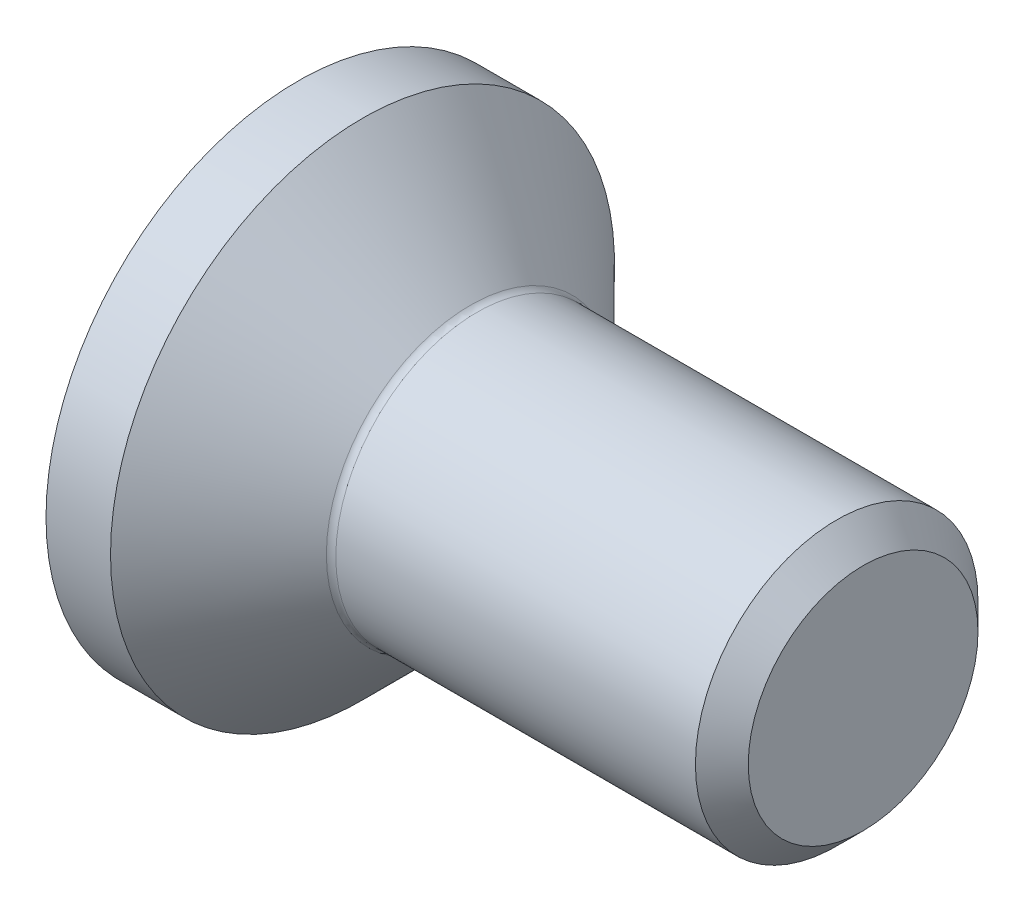
ISO-10303-21;
HEADER;
FILE_DESCRIPTION(('STEP AP214'),'2;1');
FILE_NAME('part.step','',(''),(''),'','','');
FILE_SCHEMA(('AUTOMOTIVE_DESIGN { 1 0 10303 214 1 1 1 1 }'));
ENDSEC;
DATA;
#1=APPLICATION_CONTEXT('core data for automotive mechanical design processes');
#2=APPLICATION_PROTOCOL_DEFINITION('international standard','automotive_design',2000,#1);
#3=PRODUCT_CONTEXT('',#1,'mechanical');
#4=PRODUCT('Part','Part','',(#3));
#5=PRODUCT_RELATED_PRODUCT_CATEGORY('part','',(#4));
#6=PRODUCT_DEFINITION_FORMATION('','',#4);
#7=PRODUCT_DEFINITION_CONTEXT('part definition',#1,'design');
#8=PRODUCT_DEFINITION('design','',#6,#7);
#9=PRODUCT_DEFINITION_SHAPE('','',#8);
#10=(LENGTH_UNIT() NAMED_UNIT(*) SI_UNIT(.MILLI.,.METRE.));
#11=(NAMED_UNIT(*) PLANE_ANGLE_UNIT() SI_UNIT($,.RADIAN.));
#12=(NAMED_UNIT(*) SI_UNIT($,.STERADIAN.) SOLID_ANGLE_UNIT());
#13=UNCERTAINTY_MEASURE_WITH_UNIT(LENGTH_MEASURE(1.E-05),#10,'distance_accuracy_value','');
#14=(GEOMETRIC_REPRESENTATION_CONTEXT(3) GLOBAL_UNCERTAINTY_ASSIGNED_CONTEXT((#13)) GLOBAL_UNIT_ASSIGNED_CONTEXT((#10,
#11,#12)) REPRESENTATION_CONTEXT('',''));
#15=CARTESIAN_POINT('',(0.,0.,0.));
#16=DIRECTION('',(0.,0.,1.));
#17=DIRECTION('',(1.,0.,0.));
#18=AXIS2_PLACEMENT_3D('',#15,#16,#17);
#19=CARTESIAN_POINT('',(0.,0.,0.));
#20=DIRECTION('',(-1.,0.,0.));
#21=DIRECTION('',(0.,0.,1.));
#22=AXIS2_PLACEMENT_3D('',#19,#20,#21);
#23=PLANE('',#22);
#24=CARTESIAN_POINT('',(0.,0.,0.));
#25=DIRECTION('',(-1.,0.,0.));
#26=DIRECTION('',(0.,0.,1.));
#27=AXIS2_PLACEMENT_3D('',#24,#25,#26);
#28=CIRCLE('',#27,2.675);
#29=CARTESIAN_POINT('',(0.,0.,2.675));
#30=VERTEX_POINT('',#29);
#31=EDGE_CURVE('E148',#30,#30,#28,.T.);
#32=ORIENTED_EDGE('',*,*,#31,.T.);
#33=EDGE_LOOP('',(#32));
#34=FACE_BOUND('',#33,.T.);
#35=DIRECTION('',(0.,-0.5,-0.866025403784439));
#36=VECTOR('',#35,1.);
#37=CARTESIAN_POINT('',(0.,-0.577350269189625,1.));
#38=LINE('',#37,#36);
#39=CARTESIAN_POINT('',(0.,-0.577350269189625,1.));
#40=VERTEX_POINT('',#39);
#41=CARTESIAN_POINT('',(0.,-1.15470053837925,0.));
#42=VERTEX_POINT('',#41);
#43=EDGE_CURVE('E114',#40,#42,#38,.T.);
#44=ORIENTED_EDGE('',*,*,#43,.T.);
#45=DIRECTION('',(0.,0.5,-0.866025403784439));
#46=VECTOR('',#45,1.);
#47=CARTESIAN_POINT('',(0.,-1.15470053837925,0.));
#48=LINE('',#47,#46);
#49=CARTESIAN_POINT('',(0.,-0.577350269189626,-1.));
#50=VERTEX_POINT('',#49);
#51=EDGE_CURVE('E45',#42,#50,#48,.T.);
#52=ORIENTED_EDGE('',*,*,#51,.T.);
#53=DIRECTION('',(0.,1.,0.));
#54=VECTOR('',#53,1.);
#55=CARTESIAN_POINT('',(0.,-0.577350269189626,-1.));
#56=LINE('',#55,#54);
#57=CARTESIAN_POINT('',(0.,0.577350269189627,-1.));
#58=VERTEX_POINT('',#57);
#59=EDGE_CURVE('E125',#50,#58,#56,.T.);
#60=ORIENTED_EDGE('',*,*,#59,.T.);
#61=DIRECTION('',(0.,0.5,0.866025403784438));
#62=VECTOR('',#61,1.);
#63=CARTESIAN_POINT('',(0.,0.577350269189627,-1.));
#64=LINE('',#63,#62);
#65=CARTESIAN_POINT('',(0.,1.15470053837925,0.));
#66=VERTEX_POINT('',#65);
#67=EDGE_CURVE('E249',#58,#66,#64,.T.);
#68=ORIENTED_EDGE('',*,*,#67,.T.);
#69=DIRECTION('',(0.,-0.5,0.866025403784438));
#70=VECTOR('',#69,1.);
#71=CARTESIAN_POINT('',(0.,1.15470053837925,0.));
#72=LINE('',#71,#70);
#73=CARTESIAN_POINT('',(0.,0.577350269189627,1.));
#74=VERTEX_POINT('',#73);
#75=EDGE_CURVE('E252',#66,#74,#72,.T.);
#76=ORIENTED_EDGE('',*,*,#75,.T.);
#77=DIRECTION('',(0.,-1.,0.));
#78=VECTOR('',#77,1.);
#79=CARTESIAN_POINT('',(0.,0.577350269189627,1.));
#80=LINE('',#79,#78);
#81=EDGE_CURVE('E255',#74,#40,#80,.T.);
#82=ORIENTED_EDGE('',*,*,#81,.T.);
#83=EDGE_LOOP('',(#44,#52,#60,#68,#76,#82));
#84=FACE_BOUND('',#83,.T.);
#85=ADVANCED_FACE('F30',(#34,#84),#23,.T.);
#86=CARTESIAN_POINT('',(0.,0.,0.));
#87=DIRECTION('',(-1.,0.,0.));
#88=DIRECTION('',(0.,0.,1.));
#89=AXIS2_PLACEMENT_3D('',#86,#87,#88);
#90=CYLINDRICAL_SURFACE('',#89,2.675);
#91=CARTESIAN_POINT('',(0.685000000000005,0.,0.));
#92=DIRECTION('',(-1.,0.,0.));
#93=DIRECTION('',(0.,0.,1.));
#94=AXIS2_PLACEMENT_3D('',#91,#92,#93);
#95=CIRCLE('',#94,2.675);
#96=CARTESIAN_POINT('',(0.685000000000005,0.,2.675));
#97=VERTEX_POINT('',#96);
#98=EDGE_CURVE('E145',#97,#97,#95,.T.);
#99=ORIENTED_EDGE('',*,*,#98,.T.);
#100=EDGE_LOOP('',(#99));
#101=FACE_BOUND('',#100,.T.);
#102=ORIENTED_EDGE('',*,*,#31,.F.);
#103=EDGE_LOOP('',(#102));
#104=FACE_BOUND('',#103,.T.);
#105=ADVANCED_FACE('F169',(#101,#104),#90,.T.);
#106=CARTESIAN_POINT('',(0.685000000000005,0.,0.));
#107=DIRECTION('',(-1.,0.,0.));
#108=DIRECTION('',(0.,0.,1.));
#109=AXIS2_PLACEMENT_3D('',#106,#107,#108);
#110=CONICAL_SURFACE('',#109,2.675,0.78539816339745);
#111=CARTESIAN_POINT('',(1.83071067811866,0.,0.));
#112=DIRECTION('',(-1.,0.,0.));
#113=DIRECTION('',(0.,0.,1.));
#114=AXIS2_PLACEMENT_3D('',#111,#112,#113);
#115=CIRCLE('',#114,1.52928932188134);
#116=CARTESIAN_POINT('',(1.83071067811866,0.,1.52928932188134));
#117=VERTEX_POINT('',#116);
#118=EDGE_CURVE('E38',#117,#117,#115,.T.);
#119=ORIENTED_EDGE('',*,*,#118,.T.);
#120=EDGE_LOOP('',(#119));
#121=FACE_BOUND('',#120,.T.);
#122=ORIENTED_EDGE('',*,*,#98,.F.);
#123=EDGE_LOOP('',(#122));
#124=FACE_BOUND('',#123,.T.);
#125=ADVANCED_FACE('F153',(#121,#124),#110,.T.);
#126=CARTESIAN_POINT('',(0.,0.,0.));
#127=DIRECTION('',(-1.,0.,0.));
#128=DIRECTION('',(0.,0.,1.));
#129=AXIS2_PLACEMENT_3D('',#126,#127,#128);
#130=CYLINDRICAL_SURFACE('',#129,1.5);
#131=CARTESIAN_POINT('',(1.90142135623731,0.,0.));
#132=DIRECTION('',(-1.,0.,0.));
#133=DIRECTION('',(0.,0.,1.));
#134=AXIS2_PLACEMENT_3D('',#131,#132,#133);
#135=CIRCLE('',#134,1.5);
#136=CARTESIAN_POINT('',(1.90142135623731,0.,1.5));
#137=VERTEX_POINT('',#136);
#138=EDGE_CURVE('E11',#137,#137,#135,.F.);
#139=ORIENTED_EDGE('',*,*,#138,.T.);
#140=EDGE_LOOP('',(#139));
#141=FACE_BOUND('',#140,.T.);
#142=CARTESIAN_POINT('',(5.7195,0.,0.));
#143=DIRECTION('',(-1.,0.,0.));
#144=DIRECTION('',(0.,0.,1.));
#145=AXIS2_PLACEMENT_3D('',#142,#143,#144);
#146=CIRCLE('',#145,1.49999999999999);
#147=CARTESIAN_POINT('',(5.7195,0.,1.49999999999999));
#148=VERTEX_POINT('',#147);
#149=EDGE_CURVE('E142',#148,#148,#146,.T.);
#150=ORIENTED_EDGE('',*,*,#149,.T.);
#151=EDGE_LOOP('',(#150));
#152=FACE_BOUND('',#151,.T.);
#153=ADVANCED_FACE('F180',(#141,#152),#130,.T.);
#154=CARTESIAN_POINT('',(6.,0.,0.));
#155=DIRECTION('',(-1.,0.,0.));
#156=DIRECTION('',(0.,0.,1.));
#157=AXIS2_PLACEMENT_3D('',#154,#155,#156);
#158=CONICAL_SURFACE('',#157,1.2195,0.785398163397434);
#159=ORIENTED_EDGE('',*,*,#149,.F.);
#160=EDGE_LOOP('',(#159));
#161=FACE_BOUND('',#160,.T.);
#162=CARTESIAN_POINT('',(6.,0.,0.));
#163=DIRECTION('',(-1.,0.,0.));
#164=DIRECTION('',(0.,0.,1.));
#165=AXIS2_PLACEMENT_3D('',#162,#163,#164);
#166=CIRCLE('',#165,1.2195);
#167=CARTESIAN_POINT('',(6.,0.,1.2195));
#168=VERTEX_POINT('',#167);
#169=EDGE_CURVE('E138',#168,#168,#166,.T.);
#170=ORIENTED_EDGE('',*,*,#169,.T.);
#171=EDGE_LOOP('',(#170));
#172=FACE_BOUND('',#171,.T.);
#173=ADVANCED_FACE('F164',(#161,#172),#158,.T.);
#174=CARTESIAN_POINT('',(6.,1.2195,0.));
#175=DIRECTION('',(1.,0.,0.));
#176=DIRECTION('',(0.,0.,-1.));
#177=AXIS2_PLACEMENT_3D('',#174,#175,#176);
#178=PLANE('',#177);
#179=ORIENTED_EDGE('',*,*,#169,.F.);
#180=EDGE_LOOP('',(#179));
#181=FACE_BOUND('',#180,.T.);
#182=ADVANCED_FACE('F157',(#181),#178,.T.);
#183=CARTESIAN_POINT('',(1.90142135623731,0.,0.));
#184=DIRECTION('',(-1.,0.,0.));
#185=DIRECTION('',(0.,0.,1.));
#186=AXIS2_PLACEMENT_3D('',#183,#184,#185);
#187=TOROIDAL_SURFACE('',#186,1.6,0.1);
#188=ORIENTED_EDGE('',*,*,#138,.F.);
#189=EDGE_LOOP('',(#188));
#190=FACE_BOUND('',#189,.T.);
#191=ORIENTED_EDGE('',*,*,#118,.F.);
#192=EDGE_LOOP('',(#191));
#193=FACE_BOUND('',#192,.T.);
#194=ADVANCED_FACE('F32',(#190,#193),#187,.F.);
#195=CARTESIAN_POINT('',(1.1,-1.15470053837925,0.));
#196=DIRECTION('',(0.,0.866025403784439,0.5));
#197=DIRECTION('',(0.,-0.5,0.866025403784439));
#198=AXIS2_PLACEMENT_3D('',#195,#196,#197);
#199=PLANE('',#198);
#200=ORIENTED_EDGE('',*,*,#51,.F.);
#201=DIRECTION('',(-1.,0.,0.));
#202=VECTOR('',#201,1.);
#203=CARTESIAN_POINT('',(1.1,-1.15470053837925,0.));
#204=LINE('',#203,#202);
#205=CARTESIAN_POINT('',(1.1,-1.15470053837925,0.));
#206=VERTEX_POINT('',#205);
#207=EDGE_CURVE('E246',#206,#42,#204,.T.);
#208=ORIENTED_EDGE('',*,*,#207,.F.);
#209=DIRECTION('',(0.,0.5,-0.866025403784439));
#210=VECTOR('',#209,1.);
#211=CARTESIAN_POINT('',(1.1,-1.15470053837925,0.));
#212=LINE('',#211,#210);
#213=CARTESIAN_POINT('',(1.1,-0.866025403784439,-0.499999999999999));
#214=VERTEX_POINT('',#213);
#215=EDGE_CURVE('E110',#206,#214,#212,.T.);
#216=ORIENTED_EDGE('',*,*,#215,.T.);
#217=CARTESIAN_POINT('',(1.1,-0.577350269189626,-1.));
#218=VERTEX_POINT('',#217);
#219=EDGE_CURVE('E106',#214,#218,#212,.T.);
#220=ORIENTED_EDGE('',*,*,#219,.T.);
#221=DIRECTION('',(-1.,0.,0.));
#222=VECTOR('',#221,1.);
#223=CARTESIAN_POINT('',(1.1,-0.577350269189626,-1.));
#224=LINE('',#223,#222);
#225=EDGE_CURVE('E108',#218,#50,#224,.T.);
#226=ORIENTED_EDGE('',*,*,#225,.T.);
#227=EDGE_LOOP('',(#200,#208,#216,#220,#226));
#228=FACE_BOUND('',#227,.T.);
#229=ADVANCED_FACE('F107',(#228),#199,.T.);
#230=CARTESIAN_POINT('',(1.1,-0.577350269189626,-1.));
#231=DIRECTION('',(0.,0.,1.));
#232=DIRECTION('',(1.,0.,0.));
#233=AXIS2_PLACEMENT_3D('',#230,#231,#232);
#234=PLANE('',#233);
#235=ORIENTED_EDGE('',*,*,#59,.F.);
#236=ORIENTED_EDGE('',*,*,#225,.F.);
#237=DIRECTION('',(0.,1.,0.));
#238=VECTOR('',#237,1.);
#239=CARTESIAN_POINT('',(1.1,-0.577350269189626,-1.));
#240=LINE('',#239,#238);
#241=CARTESIAN_POINT('',(1.1,0.,-1.));
#242=VERTEX_POINT('',#241);
#243=EDGE_CURVE('E53',#218,#242,#240,.T.);
#244=ORIENTED_EDGE('',*,*,#243,.T.);
#245=CARTESIAN_POINT('',(1.1,0.577350269189627,-1.));
#246=VERTEX_POINT('',#245);
#247=EDGE_CURVE('E120',#242,#246,#240,.T.);
#248=ORIENTED_EDGE('',*,*,#247,.T.);
#249=DIRECTION('',(-1.,0.,0.));
#250=VECTOR('',#249,1.);
#251=CARTESIAN_POINT('',(1.1,0.577350269189627,-1.));
#252=LINE('',#251,#250);
#253=EDGE_CURVE('E127',#246,#58,#252,.T.);
#254=ORIENTED_EDGE('',*,*,#253,.T.);
#255=EDGE_LOOP('',(#235,#236,#244,#248,#254));
#256=FACE_BOUND('',#255,.T.);
#257=ADVANCED_FACE('F122',(#256),#234,.T.);
#258=CARTESIAN_POINT('',(1.1,0.577350269189627,-1.));
#259=DIRECTION('',(0.,-0.866025403784438,0.5));
#260=DIRECTION('',(0.,-0.5,-0.866025403784438));
#261=AXIS2_PLACEMENT_3D('',#258,#259,#260);
#262=PLANE('',#261);
#263=ORIENTED_EDGE('',*,*,#67,.F.);
#264=ORIENTED_EDGE('',*,*,#253,.F.);
#265=DIRECTION('',(0.,0.5,0.866025403784438));
#266=VECTOR('',#265,1.);
#267=CARTESIAN_POINT('',(1.1,0.577350269189627,-1.));
#268=LINE('',#267,#266);
#269=CARTESIAN_POINT('',(1.1,0.866025403784439,-0.500000000000001));
#270=VERTEX_POINT('',#269);
#271=EDGE_CURVE('E227',#246,#270,#268,.T.);
#272=ORIENTED_EDGE('',*,*,#271,.T.);
#273=CARTESIAN_POINT('',(1.1,1.15470053837925,0.));
#274=VERTEX_POINT('',#273);
#275=EDGE_CURVE('E119',#270,#274,#268,.T.);
#276=ORIENTED_EDGE('',*,*,#275,.T.);
#277=DIRECTION('',(-1.,0.,0.));
#278=VECTOR('',#277,1.);
#279=CARTESIAN_POINT('',(1.1,1.15470053837925,0.));
#280=LINE('',#279,#278);
#281=EDGE_CURVE('E133',#274,#66,#280,.T.);
#282=ORIENTED_EDGE('',*,*,#281,.T.);
#283=EDGE_LOOP('',(#263,#264,#272,#276,#282));
#284=FACE_BOUND('',#283,.T.);
#285=ADVANCED_FACE('F194',(#284),#262,.T.);
#286=CARTESIAN_POINT('',(1.1,1.15470053837925,0.));
#287=DIRECTION('',(0.,-0.866025403784438,-0.5));
#288=DIRECTION('',(0.,0.5,-0.866025403784438));
#289=AXIS2_PLACEMENT_3D('',#286,#287,#288);
#290=PLANE('',#289);
#291=ORIENTED_EDGE('',*,*,#75,.F.);
#292=ORIENTED_EDGE('',*,*,#281,.F.);
#293=DIRECTION('',(0.,-0.5,0.866025403784438));
#294=VECTOR('',#293,1.);
#295=CARTESIAN_POINT('',(1.1,1.15470053837925,0.));
#296=LINE('',#295,#294);
#297=CARTESIAN_POINT('',(1.1,0.866025403784439,0.500000000000001));
#298=VERTEX_POINT('',#297);
#299=EDGE_CURVE('E234',#274,#298,#296,.T.);
#300=ORIENTED_EDGE('',*,*,#299,.T.);
#301=CARTESIAN_POINT('',(1.1,0.577350269189627,1.));
#302=VERTEX_POINT('',#301);
#303=EDGE_CURVE('E232',#298,#302,#296,.T.);
#304=ORIENTED_EDGE('',*,*,#303,.T.);
#305=DIRECTION('',(-1.,0.,0.));
#306=VECTOR('',#305,1.);
#307=CARTESIAN_POINT('',(1.1,0.577350269189627,1.));
#308=LINE('',#307,#306);
#309=EDGE_CURVE('E264',#302,#74,#308,.T.);
#310=ORIENTED_EDGE('',*,*,#309,.T.);
#311=EDGE_LOOP('',(#291,#292,#300,#304,#310));
#312=FACE_BOUND('',#311,.T.);
#313=ADVANCED_FACE('F197',(#312),#290,.T.);
#314=CARTESIAN_POINT('',(1.1,0.577350269189627,1.));
#315=DIRECTION('',(0.,0.,-1.));
#316=DIRECTION('',(-1.,0.,0.));
#317=AXIS2_PLACEMENT_3D('',#314,#315,#316);
#318=PLANE('',#317);
#319=ORIENTED_EDGE('',*,*,#81,.F.);
#320=ORIENTED_EDGE('',*,*,#309,.F.);
#321=DIRECTION('',(0.,-1.,0.));
#322=VECTOR('',#321,1.);
#323=CARTESIAN_POINT('',(1.1,0.577350269189627,1.));
#324=LINE('',#323,#322);
#325=CARTESIAN_POINT('',(1.1,0.,1.));
#326=VERTEX_POINT('',#325);
#327=EDGE_CURVE('E239',#302,#326,#324,.T.);
#328=ORIENTED_EDGE('',*,*,#327,.T.);
#329=CARTESIAN_POINT('',(1.1,-0.577350269189625,1.));
#330=VERTEX_POINT('',#329);
#331=EDGE_CURVE('E238',#326,#330,#324,.T.);
#332=ORIENTED_EDGE('',*,*,#331,.T.);
#333=DIRECTION('',(-1.,0.,0.));
#334=VECTOR('',#333,1.);
#335=CARTESIAN_POINT('',(1.1,-0.577350269189625,1.));
#336=LINE('',#335,#334);
#337=EDGE_CURVE('E261',#330,#40,#336,.T.);
#338=ORIENTED_EDGE('',*,*,#337,.T.);
#339=EDGE_LOOP('',(#319,#320,#328,#332,#338));
#340=FACE_BOUND('',#339,.T.);
#341=ADVANCED_FACE('F201',(#340),#318,.T.);
#342=CARTESIAN_POINT('',(1.1,-0.577350269189625,1.));
#343=DIRECTION('',(0.,0.866025403784439,-0.5));
#344=DIRECTION('',(0.,0.5,0.866025403784439));
#345=AXIS2_PLACEMENT_3D('',#342,#343,#344);
#346=PLANE('',#345);
#347=ORIENTED_EDGE('',*,*,#43,.F.);
#348=ORIENTED_EDGE('',*,*,#337,.F.);
#349=DIRECTION('',(0.,-0.5,-0.866025403784439));
#350=VECTOR('',#349,1.);
#351=CARTESIAN_POINT('',(1.1,-0.577350269189625,1.));
#352=LINE('',#351,#350);
#353=CARTESIAN_POINT('',(1.1,-0.866025403784438,0.499999999999999));
#354=VERTEX_POINT('',#353);
#355=EDGE_CURVE('E243',#330,#354,#352,.T.);
#356=ORIENTED_EDGE('',*,*,#355,.T.);
#357=EDGE_CURVE('E242',#354,#206,#352,.T.);
#358=ORIENTED_EDGE('',*,*,#357,.T.);
#359=ORIENTED_EDGE('',*,*,#207,.T.);
#360=EDGE_LOOP('',(#347,#348,#356,#358,#359));
#361=FACE_BOUND('',#360,.T.);
#362=ADVANCED_FACE('F205',(#361),#346,.T.);
#363=CARTESIAN_POINT('',(1.1,-0.577350269189626,-1.));
#364=DIRECTION('',(1.,0.,0.));
#365=DIRECTION('',(0.,0.,-1.));
#366=AXIS2_PLACEMENT_3D('',#363,#364,#365);
#367=PLANE('',#366);
#368=ORIENTED_EDGE('',*,*,#243,.F.);
#369=ORIENTED_EDGE('',*,*,#219,.F.);
#370=CARTESIAN_POINT('',(1.1,0.,0.));
#371=DIRECTION('',(-1.,0.,0.));
#372=DIRECTION('',(0.,0.,1.));
#373=AXIS2_PLACEMENT_3D('',#370,#371,#372);
#374=CIRCLE('',#373,1.);
#375=EDGE_CURVE('E117',#242,#214,#374,.T.);
#376=ORIENTED_EDGE('',*,*,#375,.F.);
#377=EDGE_LOOP('',(#368,#369,#376));
#378=FACE_BOUND('',#377,.T.);
#379=ADVANCED_FACE('F116',(#378),#367,.F.);
#380=ORIENTED_EDGE('',*,*,#215,.F.);
#381=ORIENTED_EDGE('',*,*,#357,.F.);
#382=EDGE_CURVE('E130',#214,#354,#374,.T.);
#383=ORIENTED_EDGE('',*,*,#382,.F.);
#384=EDGE_LOOP('',(#380,#381,#383));
#385=FACE_BOUND('',#384,.T.);
#386=ADVANCED_FACE('F211',(#385),#367,.F.);
#387=ORIENTED_EDGE('',*,*,#355,.F.);
#388=ORIENTED_EDGE('',*,*,#331,.F.);
#389=EDGE_CURVE('E126',#354,#326,#374,.T.);
#390=ORIENTED_EDGE('',*,*,#389,.F.);
#391=EDGE_LOOP('',(#387,#388,#390));
#392=FACE_BOUND('',#391,.T.);
#393=ADVANCED_FACE('F215',(#392),#367,.F.);
#394=ORIENTED_EDGE('',*,*,#327,.F.);
#395=ORIENTED_EDGE('',*,*,#303,.F.);
#396=EDGE_CURVE('E132',#326,#298,#374,.T.);
#397=ORIENTED_EDGE('',*,*,#396,.F.);
#398=EDGE_LOOP('',(#394,#395,#397));
#399=FACE_BOUND('',#398,.T.);
#400=ADVANCED_FACE('F223',(#399),#367,.F.);
#401=ORIENTED_EDGE('',*,*,#299,.F.);
#402=ORIENTED_EDGE('',*,*,#275,.F.);
#403=EDGE_CURVE('E139',#298,#270,#374,.T.);
#404=ORIENTED_EDGE('',*,*,#403,.F.);
#405=EDGE_LOOP('',(#401,#402,#404));
#406=FACE_BOUND('',#405,.T.);
#407=ADVANCED_FACE('F218',(#406),#367,.F.);
#408=ORIENTED_EDGE('',*,*,#271,.F.);
#409=ORIENTED_EDGE('',*,*,#247,.F.);
#410=EDGE_CURVE('E228',#270,#242,#374,.T.);
#411=ORIENTED_EDGE('',*,*,#410,.F.);
#412=EDGE_LOOP('',(#408,#409,#411));
#413=FACE_BOUND('',#412,.T.);
#414=ADVANCED_FACE('F189',(#413),#367,.F.);
#415=CARTESIAN_POINT('',(1.1,0.,0.));
#416=DIRECTION('',(-1.,0.,0.));
#417=DIRECTION('',(0.,0.,1.));
#418=AXIS2_PLACEMENT_3D('',#415,#416,#417);
#419=CONICAL_SURFACE('',#418,1.,1.04719755119659);
#420=CARTESIAN_POINT('',(1.67735026918963,0.,0.));
#421=VERTEX_POINT('',#420);
#422=VERTEX_LOOP('',#421);
#423=FACE_BOUND('',#422,.T.);
#424=ORIENTED_EDGE('',*,*,#396,.T.);
#425=ORIENTED_EDGE('',*,*,#403,.T.);
#426=ORIENTED_EDGE('',*,*,#410,.T.);
#427=ORIENTED_EDGE('',*,*,#375,.T.);
#428=ORIENTED_EDGE('',*,*,#382,.T.);
#429=ORIENTED_EDGE('',*,*,#389,.T.);
#430=EDGE_LOOP('',(#424,#425,#426,#427,#428,#429));
#431=FACE_BOUND('',#430,.T.);
#432=ADVANCED_FACE('F187',(#423,#431),#419,.F.);
#433=CLOSED_SHELL('',(#85,#105,#125,#153,#173,#182,#194,#229,#257,#285,#313,#341,#362,#379,#386,
#393,#400,#407,#414,#432));
#434=MANIFOLD_SOLID_BREP('B2',#433);
#435=ADVANCED_BREP_SHAPE_REPRESENTATION('',(#18,#434),#14);
#436=SHAPE_DEFINITION_REPRESENTATION(#9,#435);
ENDSEC;
END-ISO-10303-21;
